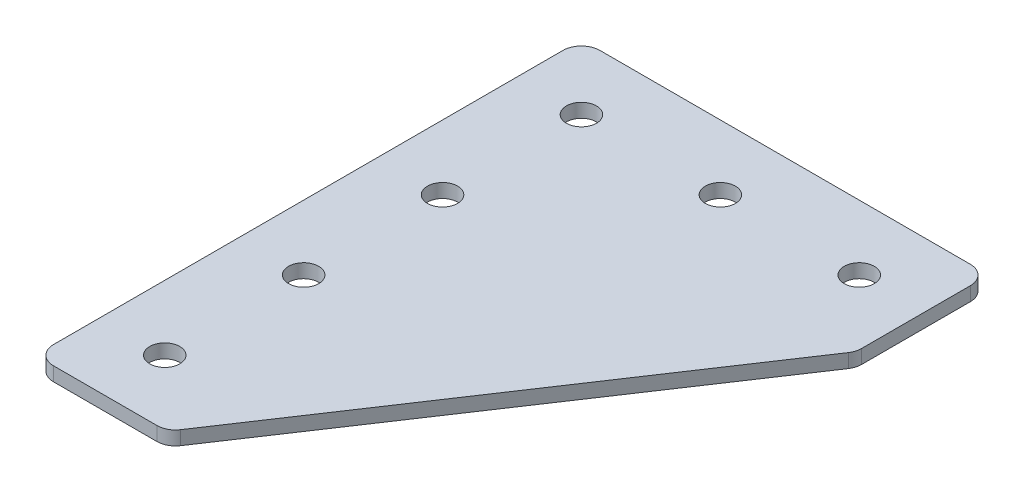
ISO-10303-21;
HEADER;
FILE_DESCRIPTION(('STEP AP214'),'2;1');
FILE_NAME('part.step','',(''),(''),'','','');
FILE_SCHEMA(('AUTOMOTIVE_DESIGN { 1 0 10303 214 1 1 1 1 }'));
ENDSEC;
DATA;
#1=APPLICATION_CONTEXT('core data for automotive mechanical design processes');
#2=APPLICATION_PROTOCOL_DEFINITION('international standard','automotive_design',2000,#1);
#3=PRODUCT_CONTEXT('',#1,'mechanical');
#4=PRODUCT('Part','Part','',(#3));
#5=PRODUCT_RELATED_PRODUCT_CATEGORY('part','',(#4));
#6=PRODUCT_DEFINITION_FORMATION('','',#4);
#7=PRODUCT_DEFINITION_CONTEXT('part definition',#1,'design');
#8=PRODUCT_DEFINITION('design','',#6,#7);
#9=PRODUCT_DEFINITION_SHAPE('','',#8);
#10=(LENGTH_UNIT() NAMED_UNIT(*) SI_UNIT(.MILLI.,.METRE.));
#11=(NAMED_UNIT(*) PLANE_ANGLE_UNIT() SI_UNIT($,.RADIAN.));
#12=(NAMED_UNIT(*) SI_UNIT($,.STERADIAN.) SOLID_ANGLE_UNIT());
#13=UNCERTAINTY_MEASURE_WITH_UNIT(LENGTH_MEASURE(1.E-05),#10,'distance_accuracy_value','');
#14=(GEOMETRIC_REPRESENTATION_CONTEXT(3) GLOBAL_UNCERTAINTY_ASSIGNED_CONTEXT((#13)) GLOBAL_UNIT_ASSIGNED_CONTEXT((#10,
#11,#12)) REPRESENTATION_CONTEXT('',''));
#15=CARTESIAN_POINT('',(0.,0.,0.));
#16=DIRECTION('',(0.,0.,1.));
#17=DIRECTION('',(1.,0.,0.));
#18=AXIS2_PLACEMENT_3D('',#15,#16,#17);
#19=CARTESIAN_POINT('',(-16.3452108311752,1.74134831028641,-23.6457325979904));
#20=DIRECTION('',(0.,-1.,0.));
#21=DIRECTION('',(0.,0.,-1.));
#22=AXIS2_PLACEMENT_3D('',#19,#20,#21);
#23=PLANE('',#22);
#24=CARTESIAN_POINT('',(-16.3452108311748,1.74134831028641,21.3542674020096));
#25=DIRECTION('',(0.,1.,0.));
#26=DIRECTION('',(0.,0.,1.));
#27=AXIS2_PLACEMENT_3D('',#24,#25,#26);
#28=CIRCLE('',#27,1.625);
#29=CARTESIAN_POINT('',(-16.3452108311748,1.74134831028641,22.9792674020096));
#30=VERTEX_POINT('',#29);
#31=EDGE_CURVE('E257',#30,#30,#28,.T.);
#32=ORIENTED_EDGE('',*,*,#31,.T.);
#33=EDGE_LOOP('',(#32));
#34=FACE_BOUND('',#33,.T.);
#35=CARTESIAN_POINT('',(-16.3452108311749,1.74134831028641,6.3542674020096));
#36=DIRECTION('',(0.,1.,0.));
#37=DIRECTION('',(0.,0.,1.));
#38=AXIS2_PLACEMENT_3D('',#35,#36,#37);
#39=CIRCLE('',#38,1.625);
#40=CARTESIAN_POINT('',(-16.3452108311749,1.74134831028641,7.9792674020096));
#41=VERTEX_POINT('',#40);
#42=EDGE_CURVE('E252',#41,#41,#39,.T.);
#43=ORIENTED_EDGE('',*,*,#42,.T.);
#44=EDGE_LOOP('',(#43));
#45=FACE_BOUND('',#44,.T.);
#46=CARTESIAN_POINT('',(-16.3452108311752,1.74134831028641,-8.6457325979904));
#47=DIRECTION('',(0.,1.,0.));
#48=DIRECTION('',(0.,0.,1.));
#49=AXIS2_PLACEMENT_3D('',#46,#47,#48);
#50=CIRCLE('',#49,1.62500000000016);
#51=CARTESIAN_POINT('',(-16.3452108311752,1.74134831028641,-7.02073259799024));
#52=VERTEX_POINT('',#51);
#53=EDGE_CURVE('E265',#52,#52,#50,.T.);
#54=ORIENTED_EDGE('',*,*,#53,.T.);
#55=EDGE_LOOP('',(#54));
#56=FACE_BOUND('',#55,.T.);
#57=CARTESIAN_POINT('',(13.6547891688248,1.74134831028641,-23.6457325979904));
#58=DIRECTION('',(0.,1.,0.));
#59=DIRECTION('',(0.,0.,1.));
#60=AXIS2_PLACEMENT_3D('',#57,#58,#59);
#61=CIRCLE('',#60,1.625);
#62=CARTESIAN_POINT('',(13.6547891688248,1.74134831028641,-22.0207325979904));
#63=VERTEX_POINT('',#62);
#64=EDGE_CURVE('E271',#63,#63,#61,.T.);
#65=ORIENTED_EDGE('',*,*,#64,.T.);
#66=EDGE_LOOP('',(#65));
#67=FACE_BOUND('',#66,.T.);
#68=CARTESIAN_POINT('',(-1.34521083117524,1.74134831028641,-23.6457325979904));
#69=DIRECTION('',(0.,1.,0.));
#70=DIRECTION('',(0.,0.,1.));
#71=AXIS2_PLACEMENT_3D('',#68,#69,#70);
#72=CIRCLE('',#71,1.625);
#73=CARTESIAN_POINT('',(-1.34521083117524,1.74134831028641,-22.0207325979904));
#74=VERTEX_POINT('',#73);
#75=EDGE_CURVE('E277',#74,#74,#72,.T.);
#76=ORIENTED_EDGE('',*,*,#75,.T.);
#77=EDGE_LOOP('',(#76));
#78=FACE_BOUND('',#77,.T.);
#79=CARTESIAN_POINT('',(-16.3452108311752,1.74134831028641,-23.6457325979904));
#80=DIRECTION('',(0.,1.,0.));
#81=DIRECTION('',(0.,0.,1.));
#82=AXIS2_PLACEMENT_3D('',#79,#80,#81);
#83=CIRCLE('',#82,1.625);
#84=CARTESIAN_POINT('',(-16.3452108311752,1.74134831028641,-22.0207325979904));
#85=VERTEX_POINT('',#84);
#86=EDGE_CURVE('E175',#85,#85,#83,.T.);
#87=ORIENTED_EDGE('',*,*,#86,.T.);
#88=EDGE_LOOP('',(#87));
#89=FACE_BOUND('',#88,.T.);
#90=DIRECTION('',(0.554700196225227,0.,-0.832050294337845));
#91=VECTOR('',#90,1.);
#92=CARTESIAN_POINT('',(-9.11280271041914,1.74134831028641,28.3542674020096));
#93=LINE('',#92,#91);
#94=CARTESIAN_POINT('',(-8.51906963871945,1.74134831028641,27.46366779446));
#95=VERTEX_POINT('',#94);
#96=CARTESIAN_POINT('',(20.3188897575003,1.74134831028641,-15.7932712998699));
#97=VERTEX_POINT('',#96);
#98=EDGE_CURVE('E121',#95,#97,#93,.T.);
#99=ORIENTED_EDGE('',*,*,#98,.F.);
#100=CARTESIAN_POINT('',(-10.1831702273951,1.74134831028641,26.3542674020096));
#101=DIRECTION('',(0.,-1.,0.));
#102=DIRECTION('',(0.,0.,-1.));
#103=AXIS2_PLACEMENT_3D('',#100,#101,#102);
#104=CIRCLE('',#103,2.);
#105=CARTESIAN_POINT('',(-10.1831702273951,1.74134831028641,28.3542674020096));
#106=VERTEX_POINT('',#105);
#107=EDGE_CURVE('E145',#95,#106,#104,.T.);
#108=ORIENTED_EDGE('',*,*,#107,.T.);
#109=DIRECTION('',(1.,0.,0.));
#110=VECTOR('',#109,1.);
#111=CARTESIAN_POINT('',(-23.3452108311753,1.74134831028641,28.3542674020096));
#112=LINE('',#111,#110);
#113=CARTESIAN_POINT('',(-21.3452108311753,1.74134831028641,28.3542674020096));
#114=VERTEX_POINT('',#113);
#115=EDGE_CURVE('E162',#114,#106,#112,.T.);
#116=ORIENTED_EDGE('',*,*,#115,.F.);
#117=CARTESIAN_POINT('',(-21.3452108311753,1.74134831028641,26.3542674020096));
#118=DIRECTION('',(0.,-1.,0.));
#119=DIRECTION('',(0.,0.,-1.));
#120=AXIS2_PLACEMENT_3D('',#117,#118,#119);
#121=CIRCLE('',#120,2.);
#122=CARTESIAN_POINT('',(-23.3452108311753,1.74134831028641,26.3542674020096));
#123=VERTEX_POINT('',#122);
#124=EDGE_CURVE('E117',#114,#123,#121,.T.);
#125=ORIENTED_EDGE('',*,*,#124,.T.);
#126=DIRECTION('',(0.,0.,1.));
#127=VECTOR('',#126,1.);
#128=CARTESIAN_POINT('',(-23.3452108311753,1.74134831028641,-30.6457325979904));
#129=LINE('',#128,#127);
#130=CARTESIAN_POINT('',(-23.3452108311753,1.74134831028641,-28.6457325979904));
#131=VERTEX_POINT('',#130);
#132=EDGE_CURVE('E160',#131,#123,#129,.T.);
#133=ORIENTED_EDGE('',*,*,#132,.F.);
#134=CARTESIAN_POINT('',(-21.3452108311753,1.74134831028641,-28.6457325979904));
#135=DIRECTION('',(0.,-1.,0.));
#136=DIRECTION('',(0.,0.,-1.));
#137=AXIS2_PLACEMENT_3D('',#134,#135,#136);
#138=CIRCLE('',#137,2.);
#139=CARTESIAN_POINT('',(-21.3452108311753,1.74134831028641,-30.6457325979904));
#140=VERTEX_POINT('',#139);
#141=EDGE_CURVE('E140',#131,#140,#138,.T.);
#142=ORIENTED_EDGE('',*,*,#141,.T.);
#143=DIRECTION('',(-1.,0.,0.));
#144=VECTOR('',#143,1.);
#145=CARTESIAN_POINT('',(20.6547891688247,1.74134831028641,-30.6457325979904));
#146=LINE('',#145,#144);
#147=CARTESIAN_POINT('',(18.6547891688247,1.74134831028641,-30.6457325979904));
#148=VERTEX_POINT('',#147);
#149=EDGE_CURVE('E163',#148,#140,#146,.T.);
#150=ORIENTED_EDGE('',*,*,#149,.F.);
#151=CARTESIAN_POINT('',(18.6547891688247,1.74134831028641,-28.6457325979904));
#152=DIRECTION('',(0.,-1.,0.));
#153=DIRECTION('',(0.,0.,-1.));
#154=AXIS2_PLACEMENT_3D('',#151,#152,#153);
#155=CIRCLE('',#154,2.);
#156=CARTESIAN_POINT('',(20.6547891688247,1.74134831028641,-28.6457325979904));
#157=VERTEX_POINT('',#156);
#158=EDGE_CURVE('E31',#148,#157,#155,.T.);
#159=ORIENTED_EDGE('',*,*,#158,.T.);
#160=DIRECTION('',(0.,0.,-1.));
#161=VECTOR('',#160,1.);
#162=CARTESIAN_POINT('',(20.6547891688247,1.74134831028641,-16.2971204168564));
#163=LINE('',#162,#161);
#164=CARTESIAN_POINT('',(20.6547891688247,1.74134831028641,-16.9026716923203));
#165=VERTEX_POINT('',#164);
#166=EDGE_CURVE('E118',#165,#157,#163,.T.);
#167=ORIENTED_EDGE('',*,*,#166,.F.);
#168=CARTESIAN_POINT('',(18.6547891688247,1.74134831028641,-16.9026716923203));
#169=DIRECTION('',(0.,-1.,0.));
#170=DIRECTION('',(0.,0.,-1.));
#171=AXIS2_PLACEMENT_3D('',#168,#169,#170);
#172=CIRCLE('',#171,2.);
#173=EDGE_CURVE('E143',#165,#97,#172,.T.);
#174=ORIENTED_EDGE('',*,*,#173,.T.);
#175=EDGE_LOOP('',(#99,#108,#116,#125,#133,#142,#150,#159,#167,#174));
#176=FACE_BOUND('',#175,.T.);
#177=ADVANCED_FACE('F16',(#34,#45,#56,#67,#78,#89,#176),#23,.T.);
#178=CARTESIAN_POINT('',(20.6547891688247,1.74134831028641,-30.6457325979904));
#179=DIRECTION('',(0.,0.,-1.));
#180=DIRECTION('',(-1.,0.,0.));
#181=AXIS2_PLACEMENT_3D('',#178,#179,#180);
#182=PLANE('',#181);
#183=DIRECTION('',(-1.,0.,0.));
#184=VECTOR('',#183,1.);
#185=CARTESIAN_POINT('',(20.6547891688247,3.24134831028641,-30.6457325979904));
#186=LINE('',#185,#184);
#187=CARTESIAN_POINT('',(18.6547891688247,3.24134831028641,-30.6457325979904));
#188=VERTEX_POINT('',#187);
#189=CARTESIAN_POINT('',(-21.3452108311753,3.24134831028641,-30.6457325979904));
#190=VERTEX_POINT('',#189);
#191=EDGE_CURVE('E172',#188,#190,#186,.T.);
#192=ORIENTED_EDGE('',*,*,#191,.F.);
#193=DIRECTION('',(0.,1.,0.));
#194=VECTOR('',#193,1.);
#195=CARTESIAN_POINT('',(18.6547891688247,1.74134831028641,-30.6457325979904));
#196=LINE('',#195,#194);
#197=EDGE_CURVE('E154',#188,#148,#196,.F.);
#198=ORIENTED_EDGE('',*,*,#197,.T.);
#199=ORIENTED_EDGE('',*,*,#149,.T.);
#200=DIRECTION('',(0.,1.,0.));
#201=VECTOR('',#200,1.);
#202=CARTESIAN_POINT('',(-21.3452108311753,1.74134831028641,-30.6457325979904));
#203=LINE('',#202,#201);
#204=EDGE_CURVE('E151',#140,#190,#203,.T.);
#205=ORIENTED_EDGE('',*,*,#204,.T.);
#206=EDGE_LOOP('',(#192,#198,#199,#205));
#207=FACE_BOUND('',#206,.T.);
#208=ADVANCED_FACE('F208',(#207),#182,.T.);
#209=CARTESIAN_POINT('',(20.6547891688247,1.74134831028641,-16.2971204168564));
#210=DIRECTION('',(1.,0.,0.));
#211=DIRECTION('',(0.,0.,-1.));
#212=AXIS2_PLACEMENT_3D('',#209,#210,#211);
#213=PLANE('',#212);
#214=DIRECTION('',(0.,0.,-1.));
#215=VECTOR('',#214,1.);
#216=CARTESIAN_POINT('',(20.6547891688247,3.24134831028641,-16.2971204168564));
#217=LINE('',#216,#215);
#218=CARTESIAN_POINT('',(20.6547891688247,3.24134831028641,-16.9026716923203));
#219=VERTEX_POINT('',#218);
#220=CARTESIAN_POINT('',(20.6547891688247,3.24134831028641,-28.6457325979904));
#221=VERTEX_POINT('',#220);
#222=EDGE_CURVE('E124',#219,#221,#217,.T.);
#223=ORIENTED_EDGE('',*,*,#222,.F.);
#224=DIRECTION('',(0.,1.,0.));
#225=VECTOR('',#224,1.);
#226=CARTESIAN_POINT('',(20.6547891688247,1.74134831028641,-16.9026716923203));
#227=LINE('',#226,#225);
#228=EDGE_CURVE('E38',#219,#165,#227,.F.);
#229=ORIENTED_EDGE('',*,*,#228,.T.);
#230=ORIENTED_EDGE('',*,*,#166,.T.);
#231=DIRECTION('',(0.,1.,0.));
#232=VECTOR('',#231,1.);
#233=CARTESIAN_POINT('',(20.6547891688247,1.74134831028641,-28.6457325979904));
#234=LINE('',#233,#232);
#235=EDGE_CURVE('E147',#157,#221,#234,.T.);
#236=ORIENTED_EDGE('',*,*,#235,.T.);
#237=EDGE_LOOP('',(#223,#229,#230,#236));
#238=FACE_BOUND('',#237,.T.);
#239=ADVANCED_FACE('F180',(#238),#213,.T.);
#240=CARTESIAN_POINT('',(-9.11280271041914,1.74134831028641,28.3542674020096));
#241=DIRECTION('',(0.832050294337845,0.,0.554700196225227));
#242=DIRECTION('',(0.554700196225227,0.,-0.832050294337845));
#243=AXIS2_PLACEMENT_3D('',#240,#241,#242);
#244=PLANE('',#243);
#245=DIRECTION('',(0.554700196225227,0.,-0.832050294337845));
#246=VECTOR('',#245,1.);
#247=CARTESIAN_POINT('',(-9.11280271041914,3.24134831028641,28.3542674020096));
#248=LINE('',#247,#246);
#249=CARTESIAN_POINT('',(-8.51906963871945,3.24134831028641,27.46366779446));
#250=VERTEX_POINT('',#249);
#251=CARTESIAN_POINT('',(20.3188897575003,3.24134831028641,-15.7932712998699));
#252=VERTEX_POINT('',#251);
#253=EDGE_CURVE('E114',#250,#252,#248,.T.);
#254=ORIENTED_EDGE('',*,*,#253,.F.);
#255=DIRECTION('',(0.,1.,0.));
#256=VECTOR('',#255,1.);
#257=CARTESIAN_POINT('',(-8.51906963871945,1.74134831028641,27.46366779446));
#258=LINE('',#257,#256);
#259=EDGE_CURVE('E137',#250,#95,#258,.F.);
#260=ORIENTED_EDGE('',*,*,#259,.T.);
#261=ORIENTED_EDGE('',*,*,#98,.T.);
#262=DIRECTION('',(0.,1.,0.));
#263=VECTOR('',#262,1.);
#264=CARTESIAN_POINT('',(20.3188897575003,1.74134831028641,-15.7932712998699));
#265=LINE('',#264,#263);
#266=EDGE_CURVE('E134',#97,#252,#265,.T.);
#267=ORIENTED_EDGE('',*,*,#266,.T.);
#268=EDGE_LOOP('',(#254,#260,#261,#267));
#269=FACE_BOUND('',#268,.T.);
#270=ADVANCED_FACE('F189',(#269),#244,.T.);
#271=CARTESIAN_POINT('',(-23.3452108311753,1.74134831028641,28.3542674020096));
#272=DIRECTION('',(0.,0.,1.));
#273=DIRECTION('',(1.,0.,0.));
#274=AXIS2_PLACEMENT_3D('',#271,#272,#273);
#275=PLANE('',#274);
#276=ORIENTED_EDGE('',*,*,#115,.T.);
#277=DIRECTION('',(0.,1.,0.));
#278=VECTOR('',#277,1.);
#279=CARTESIAN_POINT('',(-10.1831702273951,1.74134831028641,28.3542674020096));
#280=LINE('',#279,#278);
#281=CARTESIAN_POINT('',(-10.1831702273951,3.24134831028641,28.3542674020096));
#282=VERTEX_POINT('',#281);
#283=EDGE_CURVE('E105',#106,#282,#280,.T.);
#284=ORIENTED_EDGE('',*,*,#283,.T.);
#285=DIRECTION('',(1.,0.,0.));
#286=VECTOR('',#285,1.);
#287=CARTESIAN_POINT('',(-23.3452108311753,3.24134831028641,28.3542674020096));
#288=LINE('',#287,#286);
#289=CARTESIAN_POINT('',(-21.3452108311753,3.24134831028641,28.3542674020096));
#290=VERTEX_POINT('',#289);
#291=EDGE_CURVE('E97',#290,#282,#288,.T.);
#292=ORIENTED_EDGE('',*,*,#291,.F.);
#293=DIRECTION('',(0.,1.,0.));
#294=VECTOR('',#293,1.);
#295=CARTESIAN_POINT('',(-21.3452108311753,1.74134831028641,28.3542674020096));
#296=LINE('',#295,#294);
#297=EDGE_CURVE('E111',#290,#114,#296,.F.);
#298=ORIENTED_EDGE('',*,*,#297,.T.);
#299=EDGE_LOOP('',(#276,#284,#292,#298));
#300=FACE_BOUND('',#299,.T.);
#301=ADVANCED_FACE('F110',(#300),#275,.T.);
#302=CARTESIAN_POINT('',(-23.3452108311753,1.74134831028641,-30.6457325979904));
#303=DIRECTION('',(-1.,0.,0.));
#304=DIRECTION('',(0.,0.,1.));
#305=AXIS2_PLACEMENT_3D('',#302,#303,#304);
#306=PLANE('',#305);
#307=DIRECTION('',(0.,0.,1.));
#308=VECTOR('',#307,1.);
#309=CARTESIAN_POINT('',(-23.3452108311753,3.24134831028641,-30.6457325979904));
#310=LINE('',#309,#308);
#311=CARTESIAN_POINT('',(-23.3452108311753,3.24134831028641,-28.6457325979904));
#312=VERTEX_POINT('',#311);
#313=CARTESIAN_POINT('',(-23.3452108311753,3.24134831028641,26.3542674020096));
#314=VERTEX_POINT('',#313);
#315=EDGE_CURVE('E99',#312,#314,#310,.T.);
#316=ORIENTED_EDGE('',*,*,#315,.F.);
#317=DIRECTION('',(0.,1.,0.));
#318=VECTOR('',#317,1.);
#319=CARTESIAN_POINT('',(-23.3452108311753,1.74134831028641,-28.6457325979904));
#320=LINE('',#319,#318);
#321=EDGE_CURVE('E10',#312,#131,#320,.F.);
#322=ORIENTED_EDGE('',*,*,#321,.T.);
#323=ORIENTED_EDGE('',*,*,#132,.T.);
#324=DIRECTION('',(0.,1.,0.));
#325=VECTOR('',#324,1.);
#326=CARTESIAN_POINT('',(-23.3452108311753,1.74134831028641,26.3542674020096));
#327=LINE('',#326,#325);
#328=EDGE_CURVE('E24',#123,#314,#327,.T.);
#329=ORIENTED_EDGE('',*,*,#328,.T.);
#330=EDGE_LOOP('',(#316,#322,#323,#329));
#331=FACE_BOUND('',#330,.T.);
#332=ADVANCED_FACE('F157',(#331),#306,.T.);
#333=CARTESIAN_POINT('',(-16.3452108311752,3.24134831028641,-23.6457325979904));
#334=DIRECTION('',(0.,-1.,0.));
#335=DIRECTION('',(0.,0.,-1.));
#336=AXIS2_PLACEMENT_3D('',#333,#334,#335);
#337=PLANE('',#336);
#338=CARTESIAN_POINT('',(-16.3452108311748,3.24134831028641,21.3542674020096));
#339=DIRECTION('',(0.,1.,0.));
#340=DIRECTION('',(0.,0.,1.));
#341=AXIS2_PLACEMENT_3D('',#338,#339,#340);
#342=CIRCLE('',#341,1.625);
#343=CARTESIAN_POINT('',(-16.3452108311748,3.24134831028641,22.9792674020096));
#344=VERTEX_POINT('',#343);
#345=EDGE_CURVE('E261',#344,#344,#342,.T.);
#346=ORIENTED_EDGE('',*,*,#345,.F.);
#347=EDGE_LOOP('',(#346));
#348=FACE_BOUND('',#347,.T.);
#349=CARTESIAN_POINT('',(-16.3452108311749,3.24134831028641,6.3542674020096));
#350=DIRECTION('',(0.,1.,0.));
#351=DIRECTION('',(0.,0.,1.));
#352=AXIS2_PLACEMENT_3D('',#349,#350,#351);
#353=CIRCLE('',#352,1.625);
#354=CARTESIAN_POINT('',(-16.3452108311749,3.24134831028641,7.9792674020096));
#355=VERTEX_POINT('',#354);
#356=EDGE_CURVE('E255',#355,#355,#353,.T.);
#357=ORIENTED_EDGE('',*,*,#356,.F.);
#358=EDGE_LOOP('',(#357));
#359=FACE_BOUND('',#358,.T.);
#360=CARTESIAN_POINT('',(-16.3452108311752,3.24134831028641,-8.6457325979904));
#361=DIRECTION('',(0.,1.,0.));
#362=DIRECTION('',(0.,0.,1.));
#363=AXIS2_PLACEMENT_3D('',#360,#361,#362);
#364=CIRCLE('',#363,1.62500000000016);
#365=CARTESIAN_POINT('',(-16.3452108311752,3.24134831028641,-7.02073259799024));
#366=VERTEX_POINT('',#365);
#367=EDGE_CURVE('E259',#366,#366,#364,.T.);
#368=ORIENTED_EDGE('',*,*,#367,.F.);
#369=EDGE_LOOP('',(#368));
#370=FACE_BOUND('',#369,.T.);
#371=CARTESIAN_POINT('',(13.6547891688248,3.24134831028641,-23.6457325979904));
#372=DIRECTION('',(0.,1.,0.));
#373=DIRECTION('',(0.,0.,1.));
#374=AXIS2_PLACEMENT_3D('',#371,#372,#373);
#375=CIRCLE('',#374,1.625);
#376=CARTESIAN_POINT('',(13.6547891688248,3.24134831028641,-22.0207325979904));
#377=VERTEX_POINT('',#376);
#378=EDGE_CURVE('E268',#377,#377,#375,.T.);
#379=ORIENTED_EDGE('',*,*,#378,.F.);
#380=EDGE_LOOP('',(#379));
#381=FACE_BOUND('',#380,.T.);
#382=CARTESIAN_POINT('',(-1.34521083117524,3.24134831028641,-23.6457325979904));
#383=DIRECTION('',(0.,1.,0.));
#384=DIRECTION('',(0.,0.,1.));
#385=AXIS2_PLACEMENT_3D('',#382,#383,#384);
#386=CIRCLE('',#385,1.625);
#387=CARTESIAN_POINT('',(-1.34521083117524,3.24134831028641,-22.0207325979904));
#388=VERTEX_POINT('',#387);
#389=EDGE_CURVE('E274',#388,#388,#386,.T.);
#390=ORIENTED_EDGE('',*,*,#389,.F.);
#391=EDGE_LOOP('',(#390));
#392=FACE_BOUND('',#391,.T.);
#393=CARTESIAN_POINT('',(-16.3452108311752,3.24134831028641,-23.6457325979904));
#394=DIRECTION('',(0.,1.,0.));
#395=DIRECTION('',(0.,0.,1.));
#396=AXIS2_PLACEMENT_3D('',#393,#394,#395);
#397=CIRCLE('',#396,1.625);
#398=CARTESIAN_POINT('',(-16.3452108311752,3.24134831028641,-22.0207325979904));
#399=VERTEX_POINT('',#398);
#400=EDGE_CURVE('E280',#399,#399,#397,.T.);
#401=ORIENTED_EDGE('',*,*,#400,.F.);
#402=EDGE_LOOP('',(#401));
#403=FACE_BOUND('',#402,.T.);
#404=ORIENTED_EDGE('',*,*,#291,.T.);
#405=CARTESIAN_POINT('',(-10.1831702273951,3.24134831028641,26.3542674020096));
#406=DIRECTION('',(0.,-1.,0.));
#407=DIRECTION('',(0.,0.,-1.));
#408=AXIS2_PLACEMENT_3D('',#405,#406,#407);
#409=CIRCLE('',#408,2.);
#410=EDGE_CURVE('E132',#282,#250,#409,.F.);
#411=ORIENTED_EDGE('',*,*,#410,.T.);
#412=ORIENTED_EDGE('',*,*,#253,.T.);
#413=CARTESIAN_POINT('',(18.6547891688247,3.24134831028641,-16.9026716923203));
#414=DIRECTION('',(0.,-1.,0.));
#415=DIRECTION('',(0.,0.,-1.));
#416=AXIS2_PLACEMENT_3D('',#413,#414,#415);
#417=CIRCLE('',#416,2.);
#418=EDGE_CURVE('E130',#252,#219,#417,.F.);
#419=ORIENTED_EDGE('',*,*,#418,.T.);
#420=ORIENTED_EDGE('',*,*,#222,.T.);
#421=CARTESIAN_POINT('',(18.6547891688247,3.24134831028641,-28.6457325979904));
#422=DIRECTION('',(0.,-1.,0.));
#423=DIRECTION('',(0.,0.,-1.));
#424=AXIS2_PLACEMENT_3D('',#421,#422,#423);
#425=CIRCLE('',#424,2.);
#426=EDGE_CURVE('E128',#221,#188,#425,.F.);
#427=ORIENTED_EDGE('',*,*,#426,.T.);
#428=ORIENTED_EDGE('',*,*,#191,.T.);
#429=CARTESIAN_POINT('',(-21.3452108311753,3.24134831028641,-28.6457325979904));
#430=DIRECTION('',(0.,-1.,0.));
#431=DIRECTION('',(0.,0.,-1.));
#432=AXIS2_PLACEMENT_3D('',#429,#430,#431);
#433=CIRCLE('',#432,2.);
#434=EDGE_CURVE('E104',#190,#312,#433,.F.);
#435=ORIENTED_EDGE('',*,*,#434,.T.);
#436=ORIENTED_EDGE('',*,*,#315,.T.);
#437=CARTESIAN_POINT('',(-21.3452108311753,3.24134831028641,26.3542674020096));
#438=DIRECTION('',(0.,-1.,0.));
#439=DIRECTION('',(0.,0.,-1.));
#440=AXIS2_PLACEMENT_3D('',#437,#438,#439);
#441=CIRCLE('',#440,2.);
#442=EDGE_CURVE('E94',#314,#290,#441,.F.);
#443=ORIENTED_EDGE('',*,*,#442,.T.);
#444=EDGE_LOOP('',(#404,#411,#412,#419,#420,#427,#428,#435,#436,#443));
#445=FACE_BOUND('',#444,.T.);
#446=ADVANCED_FACE('F96',(#348,#359,#370,#381,#392,#403,#445),#337,.F.);
#447=CARTESIAN_POINT('',(-16.3452108311752,1.74134831028641,-23.6457325979904));
#448=DIRECTION('',(0.,1.,0.));
#449=DIRECTION('',(0.,0.,1.));
#450=AXIS2_PLACEMENT_3D('',#447,#448,#449);
#451=CYLINDRICAL_SURFACE('',#450,1.625);
#452=ORIENTED_EDGE('',*,*,#86,.F.);
#453=EDGE_LOOP('',(#452));
#454=FACE_BOUND('',#453,.T.);
#455=ORIENTED_EDGE('',*,*,#400,.T.);
#456=EDGE_LOOP('',(#455));
#457=FACE_BOUND('',#456,.T.);
#458=ADVANCED_FACE('F219',(#454,#457),#451,.F.);
#459=CARTESIAN_POINT('',(-1.34521083117524,1.74134831028641,-23.6457325979904));
#460=DIRECTION('',(0.,1.,0.));
#461=DIRECTION('',(0.,0.,1.));
#462=AXIS2_PLACEMENT_3D('',#459,#460,#461);
#463=CYLINDRICAL_SURFACE('',#462,1.625);
#464=ORIENTED_EDGE('',*,*,#75,.F.);
#465=EDGE_LOOP('',(#464));
#466=FACE_BOUND('',#465,.T.);
#467=ORIENTED_EDGE('',*,*,#389,.T.);
#468=EDGE_LOOP('',(#467));
#469=FACE_BOUND('',#468,.T.);
#470=ADVANCED_FACE('F232',(#466,#469),#463,.F.);
#471=CARTESIAN_POINT('',(13.6547891688248,1.74134831028641,-23.6457325979904));
#472=DIRECTION('',(0.,1.,0.));
#473=DIRECTION('',(0.,0.,1.));
#474=AXIS2_PLACEMENT_3D('',#471,#472,#473);
#475=CYLINDRICAL_SURFACE('',#474,1.625);
#476=ORIENTED_EDGE('',*,*,#64,.F.);
#477=EDGE_LOOP('',(#476));
#478=FACE_BOUND('',#477,.T.);
#479=ORIENTED_EDGE('',*,*,#378,.T.);
#480=EDGE_LOOP('',(#479));
#481=FACE_BOUND('',#480,.T.);
#482=ADVANCED_FACE('F236',(#478,#481),#475,.F.);
#483=CARTESIAN_POINT('',(-16.3452108311752,1.74134831028641,-8.6457325979904));
#484=DIRECTION('',(0.,1.,0.));
#485=DIRECTION('',(0.,0.,1.));
#486=AXIS2_PLACEMENT_3D('',#483,#484,#485);
#487=CYLINDRICAL_SURFACE('',#486,1.62500000000016);
#488=ORIENTED_EDGE('',*,*,#53,.F.);
#489=EDGE_LOOP('',(#488));
#490=FACE_BOUND('',#489,.T.);
#491=ORIENTED_EDGE('',*,*,#367,.T.);
#492=EDGE_LOOP('',(#491));
#493=FACE_BOUND('',#492,.T.);
#494=ADVANCED_FACE('F240',(#490,#493),#487,.F.);
#495=CARTESIAN_POINT('',(-16.3452108311749,1.74134831028641,6.3542674020096));
#496=DIRECTION('',(0.,1.,0.));
#497=DIRECTION('',(0.,0.,1.));
#498=AXIS2_PLACEMENT_3D('',#495,#496,#497);
#499=CYLINDRICAL_SURFACE('',#498,1.625);
#500=ORIENTED_EDGE('',*,*,#42,.F.);
#501=EDGE_LOOP('',(#500));
#502=FACE_BOUND('',#501,.T.);
#503=ORIENTED_EDGE('',*,*,#356,.T.);
#504=EDGE_LOOP('',(#503));
#505=FACE_BOUND('',#504,.T.);
#506=ADVANCED_FACE('F203',(#502,#505),#499,.F.);
#507=CARTESIAN_POINT('',(-16.3452108311748,1.74134831028641,21.3542674020096));
#508=DIRECTION('',(0.,1.,0.));
#509=DIRECTION('',(0.,0.,1.));
#510=AXIS2_PLACEMENT_3D('',#507,#508,#509);
#511=CYLINDRICAL_SURFACE('',#510,1.625);
#512=ORIENTED_EDGE('',*,*,#31,.F.);
#513=EDGE_LOOP('',(#512));
#514=FACE_BOUND('',#513,.T.);
#515=ORIENTED_EDGE('',*,*,#345,.T.);
#516=EDGE_LOOP('',(#515));
#517=FACE_BOUND('',#516,.T.);
#518=ADVANCED_FACE('F194',(#514,#517),#511,.F.);
#519=CARTESIAN_POINT('',(-10.1831702273951,1.74134831028641,26.3542674020096));
#520=DIRECTION('',(0.,1.,0.));
#521=DIRECTION('',(0.,0.,1.));
#522=AXIS2_PLACEMENT_3D('',#519,#520,#521);
#523=CYLINDRICAL_SURFACE('',#522,2.);
#524=ORIENTED_EDGE('',*,*,#107,.F.);
#525=ORIENTED_EDGE('',*,*,#259,.F.);
#526=ORIENTED_EDGE('',*,*,#410,.F.);
#527=ORIENTED_EDGE('',*,*,#283,.F.);
#528=EDGE_LOOP('',(#524,#525,#526,#527));
#529=FACE_BOUND('',#528,.T.);
#530=ADVANCED_FACE('F192',(#529),#523,.T.);
#531=CARTESIAN_POINT('',(18.6547891688247,1.74134831028641,-16.9026716923203));
#532=DIRECTION('',(0.,1.,0.));
#533=DIRECTION('',(0.,0.,1.));
#534=AXIS2_PLACEMENT_3D('',#531,#532,#533);
#535=CYLINDRICAL_SURFACE('',#534,2.);
#536=ORIENTED_EDGE('',*,*,#173,.F.);
#537=ORIENTED_EDGE('',*,*,#228,.F.);
#538=ORIENTED_EDGE('',*,*,#418,.F.);
#539=ORIENTED_EDGE('',*,*,#266,.F.);
#540=EDGE_LOOP('',(#536,#537,#538,#539));
#541=FACE_BOUND('',#540,.T.);
#542=ADVANCED_FACE('F184',(#541),#535,.T.);
#543=CARTESIAN_POINT('',(18.6547891688247,1.74134831028641,-28.6457325979904));
#544=DIRECTION('',(0.,1.,0.));
#545=DIRECTION('',(0.,0.,1.));
#546=AXIS2_PLACEMENT_3D('',#543,#544,#545);
#547=CYLINDRICAL_SURFACE('',#546,2.);
#548=ORIENTED_EDGE('',*,*,#158,.F.);
#549=ORIENTED_EDGE('',*,*,#197,.F.);
#550=ORIENTED_EDGE('',*,*,#426,.F.);
#551=ORIENTED_EDGE('',*,*,#235,.F.);
#552=EDGE_LOOP('',(#548,#549,#550,#551));
#553=FACE_BOUND('',#552,.T.);
#554=ADVANCED_FACE('F201',(#553),#547,.T.);
#555=CARTESIAN_POINT('',(-21.3452108311753,1.74134831028641,-28.6457325979904));
#556=DIRECTION('',(0.,1.,0.));
#557=DIRECTION('',(0.,0.,1.));
#558=AXIS2_PLACEMENT_3D('',#555,#556,#557);
#559=CYLINDRICAL_SURFACE('',#558,2.);
#560=ORIENTED_EDGE('',*,*,#141,.F.);
#561=ORIENTED_EDGE('',*,*,#321,.F.);
#562=ORIENTED_EDGE('',*,*,#434,.F.);
#563=ORIENTED_EDGE('',*,*,#204,.F.);
#564=EDGE_LOOP('',(#560,#561,#562,#563));
#565=FACE_BOUND('',#564,.T.);
#566=ADVANCED_FACE('F339',(#565),#559,.T.);
#567=CARTESIAN_POINT('',(-21.3452108311753,1.74134831028641,26.3542674020096));
#568=DIRECTION('',(0.,1.,0.));
#569=DIRECTION('',(0.,0.,1.));
#570=AXIS2_PLACEMENT_3D('',#567,#568,#569);
#571=CYLINDRICAL_SURFACE('',#570,2.);
#572=ORIENTED_EDGE('',*,*,#124,.F.);
#573=ORIENTED_EDGE('',*,*,#297,.F.);
#574=ORIENTED_EDGE('',*,*,#442,.F.);
#575=ORIENTED_EDGE('',*,*,#328,.F.);
#576=EDGE_LOOP('',(#572,#573,#574,#575));
#577=FACE_BOUND('',#576,.T.);
#578=ADVANCED_FACE('F18',(#577),#571,.T.);
#579=CLOSED_SHELL('',(#177,#208,#239,#270,#301,#332,#446,#458,#470,#482,#494,#506,#518,#530,
#542,#554,#566,#578));
#580=MANIFOLD_SOLID_BREP('B1',#579);
#581=ADVANCED_BREP_SHAPE_REPRESENTATION('',(#18,#580),#14);
#582=SHAPE_DEFINITION_REPRESENTATION(#9,#581);
ENDSEC;
END-ISO-10303-21;
